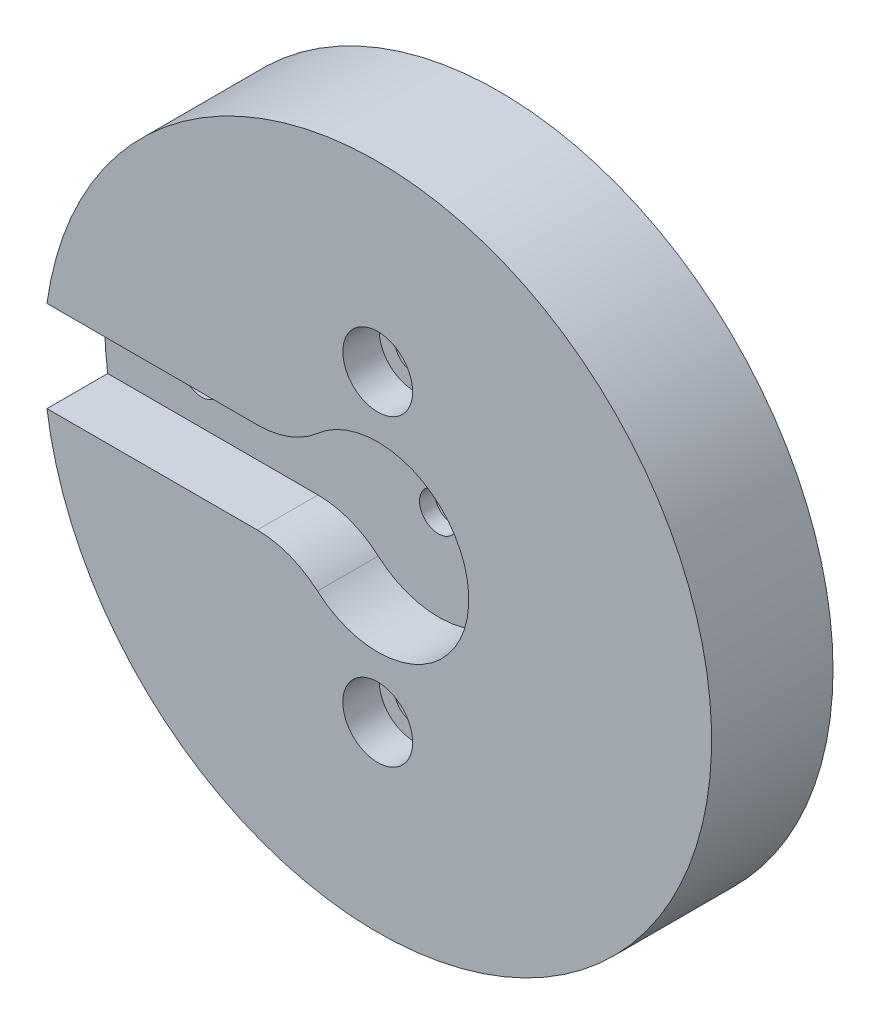
ISO-10303-21;
HEADER;
FILE_DESCRIPTION(('STEP AP214'),'2;1');
FILE_NAME('part.step','',(''),(''),'','','');
FILE_SCHEMA(('AUTOMOTIVE_DESIGN { 1 0 10303 214 1 1 1 1 }'));
ENDSEC;
DATA;
#1=APPLICATION_CONTEXT('core data for automotive mechanical design processes');
#2=APPLICATION_PROTOCOL_DEFINITION('international standard','automotive_design',2000,#1);
#3=PRODUCT_CONTEXT('',#1,'mechanical');
#4=PRODUCT('Part','Part','',(#3));
#5=PRODUCT_RELATED_PRODUCT_CATEGORY('part','',(#4));
#6=PRODUCT_DEFINITION_FORMATION('','',#4);
#7=PRODUCT_DEFINITION_CONTEXT('part definition',#1,'design');
#8=PRODUCT_DEFINITION('design','',#6,#7);
#9=PRODUCT_DEFINITION_SHAPE('','',#8);
#10=(LENGTH_UNIT() NAMED_UNIT(*) SI_UNIT(.MILLI.,.METRE.));
#11=(NAMED_UNIT(*) PLANE_ANGLE_UNIT() SI_UNIT($,.RADIAN.));
#12=(NAMED_UNIT(*) SI_UNIT($,.STERADIAN.) SOLID_ANGLE_UNIT());
#13=UNCERTAINTY_MEASURE_WITH_UNIT(LENGTH_MEASURE(1.E-05),#10,'distance_accuracy_value','');
#14=(GEOMETRIC_REPRESENTATION_CONTEXT(3) GLOBAL_UNCERTAINTY_ASSIGNED_CONTEXT((#13)) GLOBAL_UNIT_ASSIGNED_CONTEXT((#10,
#11,#12)) REPRESENTATION_CONTEXT('',''));
#15=CARTESIAN_POINT('',(0.,0.,0.));
#16=DIRECTION('',(0.,0.,1.));
#17=DIRECTION('',(1.,0.,0.));
#18=AXIS2_PLACEMENT_3D('',#15,#16,#17);
#19=CARTESIAN_POINT('',(0.,-12.7,-4.66973318295596));
#20=DIRECTION('',(0.,0.,1.));
#21=DIRECTION('',(1.,0.,0.));
#22=AXIS2_PLACEMENT_3D('',#19,#20,#21);
#23=CYLINDRICAL_SURFACE('',#22,1.651);
#24=CARTESIAN_POINT('',(0.,-12.7,0.));
#25=DIRECTION('',(0.,0.,1.));
#26=DIRECTION('',(1.,0.,0.));
#27=AXIS2_PLACEMENT_3D('',#24,#25,#26);
#28=CIRCLE('',#27,1.651);
#29=CARTESIAN_POINT('',(1.651,-12.7,0.));
#30=VERTEX_POINT('',#29);
#31=EDGE_CURVE('E161',#30,#30,#28,.F.);
#32=ORIENTED_EDGE('',*,*,#31,.T.);
#33=EDGE_LOOP('',(#32));
#34=FACE_BOUND('',#33,.T.);
#35=CARTESIAN_POINT('',(0.,-12.7,7.112));
#36=DIRECTION('',(0.,0.,1.));
#37=DIRECTION('',(1.,0.,0.));
#38=AXIS2_PLACEMENT_3D('',#35,#36,#37);
#39=CIRCLE('',#38,1.651);
#40=CARTESIAN_POINT('',(1.651,-12.7,7.112));
#41=VERTEX_POINT('',#40);
#42=EDGE_CURVE('E37',#41,#41,#39,.F.);
#43=ORIENTED_EDGE('',*,*,#42,.F.);
#44=EDGE_LOOP('',(#43));
#45=FACE_BOUND('',#44,.T.);
#46=ADVANCED_FACE('F33',(#34,#45),#23,.F.);
#47=CARTESIAN_POINT('',(0.,12.7,-4.66973318295596));
#48=DIRECTION('',(0.,0.,1.));
#49=DIRECTION('',(1.,0.,0.));
#50=AXIS2_PLACEMENT_3D('',#47,#48,#49);
#51=CYLINDRICAL_SURFACE('',#50,1.651);
#52=CARTESIAN_POINT('',(0.,12.7,0.));
#53=DIRECTION('',(0.,0.,1.));
#54=DIRECTION('',(1.,0.,0.));
#55=AXIS2_PLACEMENT_3D('',#52,#53,#54);
#56=CIRCLE('',#55,1.651);
#57=CARTESIAN_POINT('',(1.651,12.7,0.));
#58=VERTEX_POINT('',#57);
#59=EDGE_CURVE('E154',#58,#58,#56,.F.);
#60=ORIENTED_EDGE('',*,*,#59,.T.);
#61=EDGE_LOOP('',(#60));
#62=FACE_BOUND('',#61,.T.);
#63=CARTESIAN_POINT('',(0.,12.7,7.112));
#64=DIRECTION('',(0.,0.,1.));
#65=DIRECTION('',(1.,0.,0.));
#66=AXIS2_PLACEMENT_3D('',#63,#64,#65);
#67=CIRCLE('',#66,1.651);
#68=CARTESIAN_POINT('',(1.651,12.7,7.112));
#69=VERTEX_POINT('',#68);
#70=EDGE_CURVE('E155',#69,#69,#67,.F.);
#71=ORIENTED_EDGE('',*,*,#70,.F.);
#72=EDGE_LOOP('',(#71));
#73=FACE_BOUND('',#72,.T.);
#74=ADVANCED_FACE('F217',(#62,#73),#51,.F.);
#75=CARTESIAN_POINT('',(-19.812,0.,-19.05));
#76=DIRECTION('',(0.,0.,1.));
#77=DIRECTION('',(1.,0.,0.));
#78=AXIS2_PLACEMENT_3D('',#75,#76,#77);
#79=CYLINDRICAL_SURFACE('',#78,1.5875);
#80=CARTESIAN_POINT('',(-19.812,0.,5.08));
#81=DIRECTION('',(0.,0.,1.));
#82=DIRECTION('',(1.,0.,0.));
#83=AXIS2_PLACEMENT_3D('',#80,#81,#82);
#84=CIRCLE('',#83,1.5875);
#85=CARTESIAN_POINT('',(-18.2245,0.,5.08));
#86=VERTEX_POINT('',#85);
#87=EDGE_CURVE('E115',#86,#86,#84,.T.);
#88=ORIENTED_EDGE('',*,*,#87,.T.);
#89=EDGE_LOOP('',(#88));
#90=FACE_BOUND('',#89,.T.);
#91=CARTESIAN_POINT('',(-19.812,0.,3.81));
#92=DIRECTION('',(0.,0.,-1.));
#93=DIRECTION('',(-1.,0.,0.));
#94=AXIS2_PLACEMENT_3D('',#91,#92,#93);
#95=CIRCLE('',#94,1.5875);
#96=CARTESIAN_POINT('',(-21.3995,0.,3.81));
#97=VERTEX_POINT('',#96);
#98=EDGE_CURVE('E143',#97,#97,#95,.F.);
#99=ORIENTED_EDGE('',*,*,#98,.F.);
#100=EDGE_LOOP('',(#99));
#101=FACE_BOUND('',#100,.T.);
#102=ADVANCED_FACE('F194',(#90,#101),#79,.F.);
#103=CARTESIAN_POINT('',(0.,0.,0.));
#104=DIRECTION('',(0.,0.,1.));
#105=DIRECTION('',(1.,0.,0.));
#106=AXIS2_PLACEMENT_3D('',#103,#104,#105);
#107=PLANE('',#106);
#108=ORIENTED_EDGE('',*,*,#59,.F.);
#109=EDGE_LOOP('',(#108));
#110=FACE_BOUND('',#109,.T.);
#111=ORIENTED_EDGE('',*,*,#31,.F.);
#112=EDGE_LOOP('',(#111));
#113=FACE_BOUND('',#112,.T.);
#114=CARTESIAN_POINT('',(0.,0.,0.));
#115=DIRECTION('',(0.,0.,1.));
#116=DIRECTION('',(1.,0.,0.));
#117=AXIS2_PLACEMENT_3D('',#114,#115,#116);
#118=CIRCLE('',#117,27.94);
#119=CARTESIAN_POINT('',(27.94,0.,0.));
#120=VERTEX_POINT('',#119);
#121=EDGE_CURVE('E42',#120,#120,#118,.T.);
#122=ORIENTED_EDGE('',*,*,#121,.F.);
#123=EDGE_LOOP('',(#122));
#124=FACE_BOUND('',#123,.T.);
#125=CARTESIAN_POINT('',(-19.812,0.,0.));
#126=DIRECTION('',(0.,0.,-1.));
#127=DIRECTION('',(-1.,0.,0.));
#128=AXIS2_PLACEMENT_3D('',#125,#126,#127);
#129=CIRCLE('',#128,2.74955);
#130=CARTESIAN_POINT('',(-22.56155,0.,0.));
#131=VERTEX_POINT('',#130);
#132=EDGE_CURVE('E184',#131,#131,#129,.T.);
#133=ORIENTED_EDGE('',*,*,#132,.F.);
#134=EDGE_LOOP('',(#133));
#135=FACE_BOUND('',#134,.T.);
#136=CARTESIAN_POINT('',(0.,0.,0.));
#137=DIRECTION('',(0.,0.,1.));
#138=DIRECTION('',(1.,0.,0.));
#139=AXIS2_PLACEMENT_3D('',#136,#137,#138);
#140=CIRCLE('',#139,2.794);
#141=CARTESIAN_POINT('',(2.794,0.,0.));
#142=VERTEX_POINT('',#141);
#143=EDGE_CURVE('E152',#142,#142,#140,.F.);
#144=ORIENTED_EDGE('',*,*,#143,.F.);
#145=EDGE_LOOP('',(#144));
#146=FACE_BOUND('',#145,.T.);
#147=ADVANCED_FACE('F191',(#110,#113,#124,#135,#146),#107,.F.);
#148=CARTESIAN_POINT('',(0.,0.,10.16));
#149=DIRECTION('',(0.,0.,-1.));
#150=DIRECTION('',(-1.,0.,0.));
#151=AXIS2_PLACEMENT_3D('',#148,#149,#150);
#152=CYLINDRICAL_SURFACE('',#151,27.94);
#153=CARTESIAN_POINT('',(0.,0.,10.16));
#154=DIRECTION('',(0.,0.,1.));
#155=DIRECTION('',(1.,0.,0.));
#156=AXIS2_PLACEMENT_3D('',#153,#154,#155);
#157=CIRCLE('',#156,27.94);
#158=CARTESIAN_POINT('',(-27.6790082914833,-3.81,10.16));
#159=VERTEX_POINT('',#158);
#160=CARTESIAN_POINT('',(-27.6790082914833,3.81,10.16));
#161=VERTEX_POINT('',#160);
#162=EDGE_CURVE('E11',#159,#161,#157,.T.);
#163=ORIENTED_EDGE('',*,*,#162,.F.);
#164=DIRECTION('',(0.,0.,-1.));
#165=VECTOR('',#164,1.);
#166=CARTESIAN_POINT('',(-27.6790082914833,-3.81,10.16));
#167=LINE('',#166,#165);
#168=CARTESIAN_POINT('',(-27.6790082914833,-3.81,5.08));
#169=VERTEX_POINT('',#168);
#170=EDGE_CURVE('E138',#159,#169,#167,.T.);
#171=ORIENTED_EDGE('',*,*,#170,.T.);
#172=CARTESIAN_POINT('',(0.,0.,5.08));
#173=DIRECTION('',(0.,0.,-1.));
#174=DIRECTION('',(-1.,0.,0.));
#175=AXIS2_PLACEMENT_3D('',#172,#173,#174);
#176=CIRCLE('',#175,27.94);
#177=CARTESIAN_POINT('',(-27.6790082914833,3.81,5.08));
#178=VERTEX_POINT('',#177);
#179=EDGE_CURVE('E131',#169,#178,#176,.T.);
#180=ORIENTED_EDGE('',*,*,#179,.T.);
#181=DIRECTION('',(0.,0.,-1.));
#182=VECTOR('',#181,1.);
#183=CARTESIAN_POINT('',(-27.6790082914833,3.81,10.16));
#184=LINE('',#183,#182);
#185=EDGE_CURVE('E58',#178,#161,#184,.F.);
#186=ORIENTED_EDGE('',*,*,#185,.T.);
#187=EDGE_LOOP('',(#163,#171,#180,#186));
#188=FACE_BOUND('',#187,.T.);
#189=ORIENTED_EDGE('',*,*,#121,.T.);
#190=EDGE_LOOP('',(#189));
#191=FACE_BOUND('',#190,.T.);
#192=ADVANCED_FACE('F35',(#188,#191),#152,.T.);
#193=CARTESIAN_POINT('',(0.,0.,10.16));
#194=DIRECTION('',(0.,0.,1.));
#195=DIRECTION('',(1.,0.,0.));
#196=AXIS2_PLACEMENT_3D('',#193,#194,#195);
#197=PLANE('',#196);
#198=CARTESIAN_POINT('',(0.,12.7,10.16));
#199=DIRECTION('',(0.,0.,1.));
#200=DIRECTION('',(1.,0.,0.));
#201=AXIS2_PLACEMENT_3D('',#198,#199,#200);
#202=CIRCLE('',#201,2.921);
#203=CARTESIAN_POINT('',(2.921,12.7,10.16));
#204=VERTEX_POINT('',#203);
#205=EDGE_CURVE('E163',#204,#204,#202,.T.);
#206=ORIENTED_EDGE('',*,*,#205,.F.);
#207=EDGE_LOOP('',(#206));
#208=FACE_BOUND('',#207,.T.);
#209=CARTESIAN_POINT('',(0.,-12.7,10.16));
#210=DIRECTION('',(0.,0.,1.));
#211=DIRECTION('',(1.,0.,0.));
#212=AXIS2_PLACEMENT_3D('',#209,#210,#211);
#213=CIRCLE('',#212,2.921);
#214=CARTESIAN_POINT('',(2.921,-12.7,10.16));
#215=VERTEX_POINT('',#214);
#216=EDGE_CURVE('E173',#215,#215,#213,.T.);
#217=ORIENTED_EDGE('',*,*,#216,.F.);
#218=EDGE_LOOP('',(#217));
#219=FACE_BOUND('',#218,.T.);
#220=DIRECTION('',(1.,0.,0.));
#221=VECTOR('',#220,1.);
#222=CARTESIAN_POINT('',(-10.0803124951561,-3.81,10.16));
#223=LINE('',#222,#221);
#224=CARTESIAN_POINT('',(-10.0803124951561,-3.81,10.16));
#225=VERTEX_POINT('',#224);
#226=EDGE_CURVE('E110',#159,#225,#223,.T.);
#227=ORIENTED_EDGE('',*,*,#226,.F.);
#228=ORIENTED_EDGE('',*,*,#162,.T.);
#229=DIRECTION('',(-1.,0.,0.));
#230=VECTOR('',#229,1.);
#231=CARTESIAN_POINT('',(-10.0803124951561,3.81,10.16));
#232=LINE('',#231,#230);
#233=CARTESIAN_POINT('',(-10.0803124951561,3.81,10.16));
#234=VERTEX_POINT('',#233);
#235=EDGE_CURVE('E112',#234,#161,#232,.T.);
#236=ORIENTED_EDGE('',*,*,#235,.F.);
#237=CARTESIAN_POINT('',(-10.0803124951561,11.43,10.16));
#238=DIRECTION('',(0.,0.,-1.));
#239=DIRECTION('',(1.,0.,0.));
#240=AXIS2_PLACEMENT_3D('',#237,#238,#239);
#241=CIRCLE('',#240,7.62);
#242=CARTESIAN_POINT('',(-5.04015624757805,5.715,10.16));
#243=VERTEX_POINT('',#242);
#244=EDGE_CURVE('E125',#243,#234,#241,.T.);
#245=ORIENTED_EDGE('',*,*,#244,.F.);
#246=CARTESIAN_POINT('',(0.,0.,10.16));
#247=DIRECTION('',(0.,0.,1.));
#248=DIRECTION('',(1.,0.,0.));
#249=AXIS2_PLACEMENT_3D('',#246,#247,#248);
#250=CIRCLE('',#249,7.62);
#251=CARTESIAN_POINT('',(-5.04015624757805,-5.715,10.16));
#252=VERTEX_POINT('',#251);
#253=EDGE_CURVE('E123',#252,#243,#250,.T.);
#254=ORIENTED_EDGE('',*,*,#253,.F.);
#255=CARTESIAN_POINT('',(-10.0803124951561,-11.43,10.16));
#256=DIRECTION('',(0.,0.,-1.));
#257=DIRECTION('',(-1.,0.,0.));
#258=AXIS2_PLACEMENT_3D('',#255,#256,#257);
#259=CIRCLE('',#258,7.62);
#260=EDGE_CURVE('E50',#225,#252,#259,.T.);
#261=ORIENTED_EDGE('',*,*,#260,.F.);
#262=EDGE_LOOP('',(#227,#228,#236,#245,#254,#261));
#263=FACE_BOUND('',#262,.T.);
#264=ADVANCED_FACE('F373',(#208,#219,#263),#197,.T.);
#265=CARTESIAN_POINT('',(-10.0803124951561,-3.81,5.08));
#266=DIRECTION('',(0.,-1.,0.));
#267=DIRECTION('',(1.,0.,0.));
#268=AXIS2_PLACEMENT_3D('',#265,#266,#267);
#269=PLANE('',#268);
#270=ORIENTED_EDGE('',*,*,#226,.T.);
#271=DIRECTION('',(0.,0.,1.));
#272=VECTOR('',#271,1.);
#273=CARTESIAN_POINT('',(-10.0803124951561,-3.81,5.08));
#274=LINE('',#273,#272);
#275=CARTESIAN_POINT('',(-10.0803124951561,-3.81,5.08));
#276=VERTEX_POINT('',#275);
#277=EDGE_CURVE('E129',#276,#225,#274,.T.);
#278=ORIENTED_EDGE('',*,*,#277,.F.);
#279=DIRECTION('',(1.,0.,0.));
#280=VECTOR('',#279,1.);
#281=CARTESIAN_POINT('',(-10.0803124951561,-3.81,5.08));
#282=LINE('',#281,#280);
#283=EDGE_CURVE('E97',#169,#276,#282,.T.);
#284=ORIENTED_EDGE('',*,*,#283,.F.);
#285=ORIENTED_EDGE('',*,*,#170,.F.);
#286=EDGE_LOOP('',(#270,#278,#284,#285));
#287=FACE_BOUND('',#286,.T.);
#288=ADVANCED_FACE('F364',(#287),#269,.F.);
#289=CARTESIAN_POINT('',(-10.0803124951561,3.81,5.08));
#290=DIRECTION('',(0.,1.,0.));
#291=DIRECTION('',(-1.,0.,0.));
#292=AXIS2_PLACEMENT_3D('',#289,#290,#291);
#293=PLANE('',#292);
#294=DIRECTION('',(-1.,0.,0.));
#295=VECTOR('',#294,1.);
#296=CARTESIAN_POINT('',(-10.0803124951561,3.81,5.08));
#297=LINE('',#296,#295);
#298=CARTESIAN_POINT('',(-10.0803124951561,3.81,5.08));
#299=VERTEX_POINT('',#298);
#300=EDGE_CURVE('E119',#299,#178,#297,.T.);
#301=ORIENTED_EDGE('',*,*,#300,.F.);
#302=DIRECTION('',(0.,0.,1.));
#303=VECTOR('',#302,1.);
#304=CARTESIAN_POINT('',(-10.0803124951561,3.81,5.08));
#305=LINE('',#304,#303);
#306=EDGE_CURVE('E132',#299,#234,#305,.T.);
#307=ORIENTED_EDGE('',*,*,#306,.T.);
#308=ORIENTED_EDGE('',*,*,#235,.T.);
#309=ORIENTED_EDGE('',*,*,#185,.F.);
#310=EDGE_LOOP('',(#301,#307,#308,#309));
#311=FACE_BOUND('',#310,.T.);
#312=ADVANCED_FACE('F305',(#311),#293,.F.);
#313=CARTESIAN_POINT('',(-10.0803124951561,-11.43,5.08));
#314=DIRECTION('',(0.,0.,-1.));
#315=DIRECTION('',(-1.,0.,0.));
#316=AXIS2_PLACEMENT_3D('',#313,#314,#315);
#317=PLANE('',#316);
#318=CARTESIAN_POINT('',(0.,0.,5.08));
#319=DIRECTION('',(0.,0.,-1.));
#320=DIRECTION('',(-1.,0.,0.));
#321=AXIS2_PLACEMENT_3D('',#318,#319,#320);
#322=CIRCLE('',#321,1.5875);
#323=CARTESIAN_POINT('',(-1.5875,0.,5.08));
#324=VERTEX_POINT('',#323);
#325=EDGE_CURVE('E147',#324,#324,#322,.T.);
#326=ORIENTED_EDGE('',*,*,#325,.T.);
#327=EDGE_LOOP('',(#326));
#328=FACE_BOUND('',#327,.T.);
#329=ORIENTED_EDGE('',*,*,#87,.F.);
#330=EDGE_LOOP('',(#329));
#331=FACE_BOUND('',#330,.T.);
#332=ORIENTED_EDGE('',*,*,#283,.T.);
#333=CARTESIAN_POINT('',(-10.0803124951561,-11.43,5.08));
#334=DIRECTION('',(0.,0.,-1.));
#335=DIRECTION('',(-1.,0.,0.));
#336=AXIS2_PLACEMENT_3D('',#333,#334,#335);
#337=CIRCLE('',#336,7.62);
#338=CARTESIAN_POINT('',(-5.04015624757805,-5.715,5.08));
#339=VERTEX_POINT('',#338);
#340=EDGE_CURVE('E92',#276,#339,#337,.T.);
#341=ORIENTED_EDGE('',*,*,#340,.T.);
#342=CARTESIAN_POINT('',(0.,0.,5.08));
#343=DIRECTION('',(0.,0.,1.));
#344=DIRECTION('',(1.,0.,0.));
#345=AXIS2_PLACEMENT_3D('',#342,#343,#344);
#346=CIRCLE('',#345,7.62);
#347=CARTESIAN_POINT('',(-5.04015624757805,5.715,5.08));
#348=VERTEX_POINT('',#347);
#349=EDGE_CURVE('E100',#339,#348,#346,.T.);
#350=ORIENTED_EDGE('',*,*,#349,.T.);
#351=CARTESIAN_POINT('',(-10.0803124951561,11.43,5.08));
#352=DIRECTION('',(0.,0.,-1.));
#353=DIRECTION('',(1.,0.,0.));
#354=AXIS2_PLACEMENT_3D('',#351,#352,#353);
#355=CIRCLE('',#354,7.62);
#356=EDGE_CURVE('E105',#348,#299,#355,.T.);
#357=ORIENTED_EDGE('',*,*,#356,.T.);
#358=ORIENTED_EDGE('',*,*,#300,.T.);
#359=ORIENTED_EDGE('',*,*,#179,.F.);
#360=EDGE_LOOP('',(#332,#341,#350,#357,#358,#359));
#361=FACE_BOUND('',#360,.T.);
#362=ADVANCED_FACE('F107',(#328,#331,#361),#317,.F.);
#363=CARTESIAN_POINT('',(-10.0803124951561,-11.43,5.08));
#364=DIRECTION('',(0.,0.,1.));
#365=DIRECTION('',(1.,0.,0.));
#366=AXIS2_PLACEMENT_3D('',#363,#364,#365);
#367=CYLINDRICAL_SURFACE('',#366,7.62);
#368=ORIENTED_EDGE('',*,*,#260,.T.);
#369=DIRECTION('',(0.,0.,1.));
#370=VECTOR('',#369,1.);
#371=CARTESIAN_POINT('',(-5.04015624757805,-5.715,5.08));
#372=LINE('',#371,#370);
#373=EDGE_CURVE('E88',#339,#252,#372,.T.);
#374=ORIENTED_EDGE('',*,*,#373,.F.);
#375=ORIENTED_EDGE('',*,*,#340,.F.);
#376=ORIENTED_EDGE('',*,*,#277,.T.);
#377=EDGE_LOOP('',(#368,#374,#375,#376));
#378=FACE_BOUND('',#377,.T.);
#379=ADVANCED_FACE('F90',(#378),#367,.T.);
#380=CARTESIAN_POINT('',(-10.0803124951561,11.43,5.08));
#381=DIRECTION('',(0.,0.,1.));
#382=DIRECTION('',(1.,0.,0.));
#383=AXIS2_PLACEMENT_3D('',#380,#381,#382);
#384=CYLINDRICAL_SURFACE('',#383,7.62);
#385=ORIENTED_EDGE('',*,*,#244,.T.);
#386=ORIENTED_EDGE('',*,*,#306,.F.);
#387=ORIENTED_EDGE('',*,*,#356,.F.);
#388=DIRECTION('',(0.,0.,1.));
#389=VECTOR('',#388,1.);
#390=CARTESIAN_POINT('',(-5.04015624757805,5.715,5.08));
#391=LINE('',#390,#389);
#392=EDGE_CURVE('E96',#348,#243,#391,.T.);
#393=ORIENTED_EDGE('',*,*,#392,.T.);
#394=EDGE_LOOP('',(#385,#386,#387,#393));
#395=FACE_BOUND('',#394,.T.);
#396=ADVANCED_FACE('F343',(#395),#384,.T.);
#397=CARTESIAN_POINT('',(0.,0.,5.08));
#398=DIRECTION('',(0.,0.,1.));
#399=DIRECTION('',(1.,0.,0.));
#400=AXIS2_PLACEMENT_3D('',#397,#398,#399);
#401=CYLINDRICAL_SURFACE('',#400,7.62);
#402=ORIENTED_EDGE('',*,*,#253,.T.);
#403=ORIENTED_EDGE('',*,*,#392,.F.);
#404=ORIENTED_EDGE('',*,*,#349,.F.);
#405=ORIENTED_EDGE('',*,*,#373,.T.);
#406=EDGE_LOOP('',(#402,#403,#404,#405));
#407=FACE_BOUND('',#406,.T.);
#408=ADVANCED_FACE('F101',(#407),#401,.F.);
#409=CARTESIAN_POINT('',(-19.812,0.,3.81));
#410=DIRECTION('',(0.,0.,-1.));
#411=DIRECTION('',(-1.,0.,0.));
#412=AXIS2_PLACEMENT_3D('',#409,#410,#411);
#413=PLANE('',#412);
#414=CARTESIAN_POINT('',(-19.812,0.,3.81));
#415=DIRECTION('',(0.,0.,-1.));
#416=DIRECTION('',(-1.,0.,0.));
#417=AXIS2_PLACEMENT_3D('',#414,#415,#416);
#418=CIRCLE('',#417,2.74955);
#419=CARTESIAN_POINT('',(-22.56155,0.,3.81));
#420=VERTEX_POINT('',#419);
#421=EDGE_CURVE('E146',#420,#420,#418,.T.);
#422=ORIENTED_EDGE('',*,*,#421,.T.);
#423=EDGE_LOOP('',(#422));
#424=FACE_BOUND('',#423,.T.);
#425=ORIENTED_EDGE('',*,*,#98,.T.);
#426=EDGE_LOOP('',(#425));
#427=FACE_BOUND('',#426,.T.);
#428=ADVANCED_FACE('F318',(#424,#427),#413,.T.);
#429=CARTESIAN_POINT('',(-19.812,0.,3.81));
#430=DIRECTION('',(0.,0.,-1.));
#431=DIRECTION('',(-1.,0.,0.));
#432=AXIS2_PLACEMENT_3D('',#429,#430,#431);
#433=CYLINDRICAL_SURFACE('',#432,2.74955);
#434=ORIENTED_EDGE('',*,*,#421,.F.);
#435=EDGE_LOOP('',(#434));
#436=FACE_BOUND('',#435,.T.);
#437=ORIENTED_EDGE('',*,*,#132,.T.);
#438=EDGE_LOOP('',(#437));
#439=FACE_BOUND('',#438,.T.);
#440=ADVANCED_FACE('F189',(#436,#439),#433,.F.);
#441=CARTESIAN_POINT('',(0.,0.,3.81));
#442=DIRECTION('',(0.,0.,-1.));
#443=DIRECTION('',(-1.,0.,0.));
#444=AXIS2_PLACEMENT_3D('',#441,#442,#443);
#445=CYLINDRICAL_SURFACE('',#444,2.794);
#446=ORIENTED_EDGE('',*,*,#143,.T.);
#447=EDGE_LOOP('',(#446));
#448=FACE_BOUND('',#447,.T.);
#449=CARTESIAN_POINT('',(0.,0.,3.81));
#450=DIRECTION('',(0.,0.,-1.));
#451=DIRECTION('',(-1.,0.,0.));
#452=AXIS2_PLACEMENT_3D('',#449,#450,#451);
#453=CIRCLE('',#452,2.794);
#454=CARTESIAN_POINT('',(-2.794,0.,3.81));
#455=VERTEX_POINT('',#454);
#456=EDGE_CURVE('E150',#455,#455,#453,.T.);
#457=ORIENTED_EDGE('',*,*,#456,.F.);
#458=EDGE_LOOP('',(#457));
#459=FACE_BOUND('',#458,.T.);
#460=ADVANCED_FACE('F198',(#448,#459),#445,.F.);
#461=CARTESIAN_POINT('',(0.,0.,3.81));
#462=DIRECTION('',(0.,0.,-1.));
#463=DIRECTION('',(-1.,0.,0.));
#464=AXIS2_PLACEMENT_3D('',#461,#462,#463);
#465=PLANE('',#464);
#466=CARTESIAN_POINT('',(0.,0.,3.81));
#467=DIRECTION('',(0.,0.,-1.));
#468=DIRECTION('',(-1.,0.,0.));
#469=AXIS2_PLACEMENT_3D('',#466,#467,#468);
#470=CIRCLE('',#469,1.5875);
#471=CARTESIAN_POINT('',(-1.5875,0.,3.81));
#472=VERTEX_POINT('',#471);
#473=EDGE_CURVE('E151',#472,#472,#470,.T.);
#474=ORIENTED_EDGE('',*,*,#473,.F.);
#475=EDGE_LOOP('',(#474));
#476=FACE_BOUND('',#475,.T.);
#477=ORIENTED_EDGE('',*,*,#456,.T.);
#478=EDGE_LOOP('',(#477));
#479=FACE_BOUND('',#478,.T.);
#480=ADVANCED_FACE('F201',(#476,#479),#465,.T.);
#481=CARTESIAN_POINT('',(0.,0.,11.43));
#482=DIRECTION('',(0.,0.,-1.));
#483=DIRECTION('',(-1.,0.,0.));
#484=AXIS2_PLACEMENT_3D('',#481,#482,#483);
#485=CYLINDRICAL_SURFACE('',#484,1.5875);
#486=ORIENTED_EDGE('',*,*,#473,.T.);
#487=EDGE_LOOP('',(#486));
#488=FACE_BOUND('',#487,.T.);
#489=ORIENTED_EDGE('',*,*,#325,.F.);
#490=EDGE_LOOP('',(#489));
#491=FACE_BOUND('',#490,.T.);
#492=ADVANCED_FACE('F206',(#488,#491),#485,.F.);
#493=CARTESIAN_POINT('',(0.,12.7,7.112));
#494=DIRECTION('',(0.,0.,1.));
#495=DIRECTION('',(1.,0.,0.));
#496=AXIS2_PLACEMENT_3D('',#493,#494,#495);
#497=PLANE('',#496);
#498=CARTESIAN_POINT('',(0.,12.7,7.112));
#499=DIRECTION('',(0.,0.,1.));
#500=DIRECTION('',(1.,0.,0.));
#501=AXIS2_PLACEMENT_3D('',#498,#499,#500);
#502=CIRCLE('',#501,2.921);
#503=CARTESIAN_POINT('',(2.921,12.7,7.112));
#504=VERTEX_POINT('',#503);
#505=EDGE_CURVE('E157',#504,#504,#502,.T.);
#506=ORIENTED_EDGE('',*,*,#505,.T.);
#507=EDGE_LOOP('',(#506));
#508=FACE_BOUND('',#507,.T.);
#509=ORIENTED_EDGE('',*,*,#70,.T.);
#510=EDGE_LOOP('',(#509));
#511=FACE_BOUND('',#510,.T.);
#512=ADVANCED_FACE('F212',(#508,#511),#497,.T.);
#513=CARTESIAN_POINT('',(0.,12.7,7.112));
#514=DIRECTION('',(0.,0.,1.));
#515=DIRECTION('',(1.,0.,0.));
#516=AXIS2_PLACEMENT_3D('',#513,#514,#515);
#517=CYLINDRICAL_SURFACE('',#516,2.921);
#518=ORIENTED_EDGE('',*,*,#505,.F.);
#519=EDGE_LOOP('',(#518));
#520=FACE_BOUND('',#519,.T.);
#521=ORIENTED_EDGE('',*,*,#205,.T.);
#522=EDGE_LOOP('',(#521));
#523=FACE_BOUND('',#522,.T.);
#524=ADVANCED_FACE('F234',(#520,#523),#517,.F.);
#525=CARTESIAN_POINT('',(0.,-12.7,7.112));
#526=DIRECTION('',(0.,0.,1.));
#527=DIRECTION('',(1.,0.,0.));
#528=AXIS2_PLACEMENT_3D('',#525,#526,#527);
#529=PLANE('',#528);
#530=CARTESIAN_POINT('',(0.,-12.7,7.112));
#531=DIRECTION('',(0.,0.,1.));
#532=DIRECTION('',(1.,0.,0.));
#533=AXIS2_PLACEMENT_3D('',#530,#531,#532);
#534=CIRCLE('',#533,2.921);
#535=CARTESIAN_POINT('',(2.921,-12.7,7.112));
#536=VERTEX_POINT('',#535);
#537=EDGE_CURVE('E168',#536,#536,#534,.T.);
#538=ORIENTED_EDGE('',*,*,#537,.T.);
#539=EDGE_LOOP('',(#538));
#540=FACE_BOUND('',#539,.T.);
#541=ORIENTED_EDGE('',*,*,#42,.T.);
#542=EDGE_LOOP('',(#541));
#543=FACE_BOUND('',#542,.T.);
#544=ADVANCED_FACE('F230',(#540,#543),#529,.T.);
#545=CARTESIAN_POINT('',(0.,-12.7,7.112));
#546=DIRECTION('',(0.,0.,1.));
#547=DIRECTION('',(1.,0.,0.));
#548=AXIS2_PLACEMENT_3D('',#545,#546,#547);
#549=CYLINDRICAL_SURFACE('',#548,2.921);
#550=ORIENTED_EDGE('',*,*,#537,.F.);
#551=EDGE_LOOP('',(#550));
#552=FACE_BOUND('',#551,.T.);
#553=ORIENTED_EDGE('',*,*,#216,.T.);
#554=EDGE_LOOP('',(#553));
#555=FACE_BOUND('',#554,.T.);
#556=ADVANCED_FACE('F227',(#552,#555),#549,.F.);
#557=CLOSED_SHELL('',(#46,#74,#102,#147,#192,#264,#288,#312,#362,#379,#396,#408,#428,#440,#460,
#480,#492,#512,#524,#544,#556));
#558=MANIFOLD_SOLID_BREP('B2',#557);
#559=ADVANCED_BREP_SHAPE_REPRESENTATION('',(#18,#558),#14);
#560=SHAPE_DEFINITION_REPRESENTATION(#9,#559);
ENDSEC;
END-ISO-10303-21;
